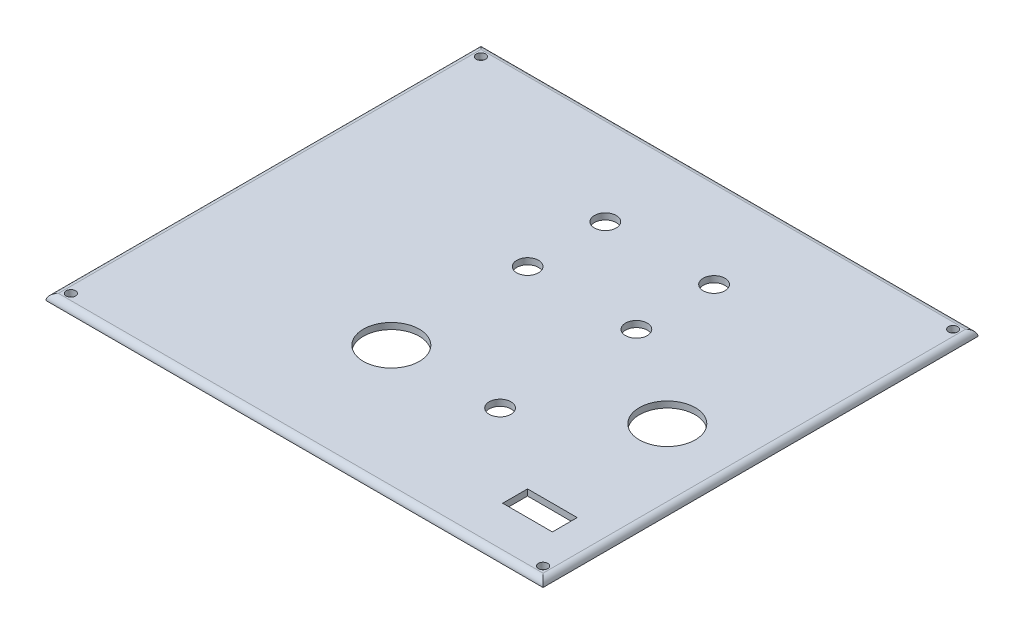
ISO-10303-21;
HEADER;
FILE_DESCRIPTION(('STEP AP214'),'2;1');
FILE_NAME('part.step','',(''),(''),'','','');
FILE_SCHEMA(('AUTOMOTIVE_DESIGN { 1 0 10303 214 1 1 1 1 }'));
ENDSEC;
DATA;
#1=APPLICATION_CONTEXT('core data for automotive mechanical design processes');
#2=APPLICATION_PROTOCOL_DEFINITION('international standard','automotive_design',2000,#1);
#3=PRODUCT_CONTEXT('',#1,'mechanical');
#4=PRODUCT('Part','Part','',(#3));
#5=PRODUCT_RELATED_PRODUCT_CATEGORY('part','',(#4));
#6=PRODUCT_DEFINITION_FORMATION('','',#4);
#7=PRODUCT_DEFINITION_CONTEXT('part definition',#1,'design');
#8=PRODUCT_DEFINITION('design','',#6,#7);
#9=PRODUCT_DEFINITION_SHAPE('','',#8);
#10=(LENGTH_UNIT() NAMED_UNIT(*) SI_UNIT(.MILLI.,.METRE.));
#11=(NAMED_UNIT(*) PLANE_ANGLE_UNIT() SI_UNIT($,.RADIAN.));
#12=(NAMED_UNIT(*) SI_UNIT($,.STERADIAN.) SOLID_ANGLE_UNIT());
#13=UNCERTAINTY_MEASURE_WITH_UNIT(LENGTH_MEASURE(1.E-05),#10,'distance_accuracy_value','');
#14=(GEOMETRIC_REPRESENTATION_CONTEXT(3) GLOBAL_UNCERTAINTY_ASSIGNED_CONTEXT((#13)) GLOBAL_UNIT_ASSIGNED_CONTEXT((#10,
#11,#12)) REPRESENTATION_CONTEXT('',''));
#15=CARTESIAN_POINT('',(0.,0.,0.));
#16=DIRECTION('',(0.,0.,1.));
#17=DIRECTION('',(1.,0.,0.));
#18=AXIS2_PLACEMENT_3D('',#15,#16,#17);
#19=CARTESIAN_POINT('',(0.,2.,0.));
#20=DIRECTION('',(0.,1.,0.));
#21=DIRECTION('',(0.,0.,1.));
#22=AXIS2_PLACEMENT_3D('',#19,#20,#21);
#23=PLANE('',#22);
#24=DIRECTION('',(0.,0.,-1.));
#25=VECTOR('',#24,1.);
#26=CARTESIAN_POINT('',(68.,2.,47.));
#27=LINE('',#26,#25);
#28=CARTESIAN_POINT('',(68.,2.,55.));
#29=VERTEX_POINT('',#28);
#30=CARTESIAN_POINT('',(68.,2.,47.));
#31=VERTEX_POINT('',#30);
#32=EDGE_CURVE('E52',#29,#31,#27,.T.);
#33=ORIENTED_EDGE('',*,*,#32,.F.);
#34=DIRECTION('',(1.,0.,0.));
#35=VECTOR('',#34,1.);
#36=CARTESIAN_POINT('',(52.,2.,55.));
#37=LINE('',#36,#35);
#38=CARTESIAN_POINT('',(52.,2.,55.));
#39=VERTEX_POINT('',#38);
#40=EDGE_CURVE('E120',#39,#29,#37,.T.);
#41=ORIENTED_EDGE('',*,*,#40,.F.);
#42=DIRECTION('',(0.,0.,1.));
#43=VECTOR('',#42,1.);
#44=CARTESIAN_POINT('',(52.,2.,47.));
#45=LINE('',#44,#43);
#46=CARTESIAN_POINT('',(52.,2.,47.));
#47=VERTEX_POINT('',#46);
#48=EDGE_CURVE('E123',#47,#39,#45,.T.);
#49=ORIENTED_EDGE('',*,*,#48,.F.);
#50=DIRECTION('',(-1.,0.,0.));
#51=VECTOR('',#50,1.);
#52=CARTESIAN_POINT('',(52.,2.,47.));
#53=LINE('',#52,#51);
#54=EDGE_CURVE('E129',#31,#47,#53,.T.);
#55=ORIENTED_EDGE('',*,*,#54,.F.);
#56=EDGE_LOOP('',(#33,#41,#49,#55));
#57=FACE_BOUND('',#56,.T.);
#58=DIRECTION('',(1.,0.,0.));
#59=VECTOR('',#58,1.);
#60=CARTESIAN_POINT('',(80.,2.,68.));
#61=LINE('',#60,#59);
#62=CARTESIAN_POINT('',(-78.,2.,68.));
#63=VERTEX_POINT('',#62);
#64=CARTESIAN_POINT('',(78.,2.,68.));
#65=VERTEX_POINT('',#64);
#66=EDGE_CURVE('E217',#63,#65,#61,.T.);
#67=ORIENTED_EDGE('',*,*,#66,.T.);
#68=DIRECTION('',(0.,0.,-1.));
#69=VECTOR('',#68,1.);
#70=CARTESIAN_POINT('',(78.,2.,-70.));
#71=LINE('',#70,#69);
#72=CARTESIAN_POINT('',(78.,2.,-68.));
#73=VERTEX_POINT('',#72);
#74=EDGE_CURVE('E11',#65,#73,#71,.T.);
#75=ORIENTED_EDGE('',*,*,#74,.T.);
#76=DIRECTION('',(-1.,0.,0.));
#77=VECTOR('',#76,1.);
#78=CARTESIAN_POINT('',(-80.,2.,-68.));
#79=LINE('',#78,#77);
#80=CARTESIAN_POINT('',(-78.,2.,-68.));
#81=VERTEX_POINT('',#80);
#82=EDGE_CURVE('E44',#73,#81,#79,.T.);
#83=ORIENTED_EDGE('',*,*,#82,.T.);
#84=DIRECTION('',(0.,0.,1.));
#85=VECTOR('',#84,1.);
#86=CARTESIAN_POINT('',(-78.,2.,70.));
#87=LINE('',#86,#85);
#88=EDGE_CURVE('E219',#81,#63,#87,.T.);
#89=ORIENTED_EDGE('',*,*,#88,.T.);
#90=EDGE_LOOP('',(#67,#75,#83,#89));
#91=FACE_BOUND('',#90,.T.);
#92=CARTESIAN_POINT('',(-9.95799999999998,2.,-40.));
#93=DIRECTION('',(0.,1.,0.));
#94=DIRECTION('',(0.,0.,1.));
#95=AXIS2_PLACEMENT_3D('',#92,#93,#94);
#96=CIRCLE('',#95,3.5);
#97=CARTESIAN_POINT('',(-9.95799999999998,2.,-36.5));
#98=VERTEX_POINT('',#97);
#99=EDGE_CURVE('E139',#98,#98,#96,.T.);
#100=ORIENTED_EDGE('',*,*,#99,.F.);
#101=EDGE_LOOP('',(#100));
#102=FACE_BOUND('',#101,.T.);
#103=CARTESIAN_POINT('',(25.042,2.,-40.));
#104=DIRECTION('',(0.,1.,0.));
#105=DIRECTION('',(0.,0.,1.));
#106=AXIS2_PLACEMENT_3D('',#103,#104,#105);
#107=CIRCLE('',#106,3.5);
#108=CARTESIAN_POINT('',(25.042,2.,-36.5));
#109=VERTEX_POINT('',#108);
#110=EDGE_CURVE('E145',#109,#109,#107,.T.);
#111=ORIENTED_EDGE('',*,*,#110,.F.);
#112=EDGE_LOOP('',(#111));
#113=FACE_BOUND('',#112,.T.);
#114=CARTESIAN_POINT('',(-9.95799999999998,2.,-15.));
#115=DIRECTION('',(0.,1.,0.));
#116=DIRECTION('',(0.,0.,1.));
#117=AXIS2_PLACEMENT_3D('',#114,#115,#116);
#118=CIRCLE('',#117,3.5);
#119=CARTESIAN_POINT('',(-9.95799999999998,2.,-11.5));
#120=VERTEX_POINT('',#119);
#121=EDGE_CURVE('E151',#120,#120,#118,.T.);
#122=ORIENTED_EDGE('',*,*,#121,.F.);
#123=EDGE_LOOP('',(#122));
#124=FACE_BOUND('',#123,.T.);
#125=CARTESIAN_POINT('',(25.042,2.,-15.));
#126=DIRECTION('',(0.,1.,0.));
#127=DIRECTION('',(0.,0.,1.));
#128=AXIS2_PLACEMENT_3D('',#125,#126,#127);
#129=CIRCLE('',#128,3.5);
#130=CARTESIAN_POINT('',(25.042,2.,-11.5));
#131=VERTEX_POINT('',#130);
#132=EDGE_CURVE('E157',#131,#131,#129,.T.);
#133=ORIENTED_EDGE('',*,*,#132,.F.);
#134=EDGE_LOOP('',(#133));
#135=FACE_BOUND('',#134,.T.);
#136=CARTESIAN_POINT('',(25.042,2.,28.878));
#137=DIRECTION('',(0.,1.,0.));
#138=DIRECTION('',(0.,0.,1.));
#139=AXIS2_PLACEMENT_3D('',#136,#137,#138);
#140=CIRCLE('',#139,3.5);
#141=CARTESIAN_POINT('',(25.042,2.,32.378));
#142=VERTEX_POINT('',#141);
#143=EDGE_CURVE('E163',#142,#142,#140,.T.);
#144=ORIENTED_EDGE('',*,*,#143,.F.);
#145=EDGE_LOOP('',(#144));
#146=FACE_BOUND('',#145,.T.);
#147=CARTESIAN_POINT('',(56.336,2.,6.34799999999999));
#148=DIRECTION('',(0.,1.,0.));
#149=DIRECTION('',(0.,0.,1.));
#150=AXIS2_PLACEMENT_3D('',#147,#148,#149);
#151=CIRCLE('',#150,8.99999999999999);
#152=CARTESIAN_POINT('',(56.336,2.,15.348));
#153=VERTEX_POINT('',#152);
#154=EDGE_CURVE('E169',#153,#153,#151,.T.);
#155=ORIENTED_EDGE('',*,*,#154,.F.);
#156=EDGE_LOOP('',(#155));
#157=FACE_BOUND('',#156,.T.);
#158=CARTESIAN_POINT('',(-9.95799999999998,2.,28.878));
#159=DIRECTION('',(0.,1.,0.));
#160=DIRECTION('',(0.,0.,1.));
#161=AXIS2_PLACEMENT_3D('',#158,#159,#160);
#162=CIRCLE('',#161,9.);
#163=CARTESIAN_POINT('',(-9.95799999999998,2.,37.878));
#164=VERTEX_POINT('',#163);
#165=EDGE_CURVE('E175',#164,#164,#162,.T.);
#166=ORIENTED_EDGE('',*,*,#165,.F.);
#167=EDGE_LOOP('',(#166));
#168=FACE_BOUND('',#167,.T.);
#169=CARTESIAN_POINT('',(-76.,2.,-66.));
#170=DIRECTION('',(0.,1.,0.));
#171=DIRECTION('',(0.,0.,1.));
#172=AXIS2_PLACEMENT_3D('',#169,#170,#171);
#173=CIRCLE('',#172,1.49999999999999);
#174=CARTESIAN_POINT('',(-76.,2.,-64.5));
#175=VERTEX_POINT('',#174);
#176=EDGE_CURVE('E181',#175,#175,#173,.T.);
#177=ORIENTED_EDGE('',*,*,#176,.F.);
#178=EDGE_LOOP('',(#177));
#179=FACE_BOUND('',#178,.T.);
#180=CARTESIAN_POINT('',(76.,2.,-66.));
#181=DIRECTION('',(0.,1.,0.));
#182=DIRECTION('',(0.,0.,1.));
#183=AXIS2_PLACEMENT_3D('',#180,#181,#182);
#184=CIRCLE('',#183,1.49999999999999);
#185=CARTESIAN_POINT('',(76.,2.,-64.5));
#186=VERTEX_POINT('',#185);
#187=EDGE_CURVE('E187',#186,#186,#184,.T.);
#188=ORIENTED_EDGE('',*,*,#187,.F.);
#189=EDGE_LOOP('',(#188));
#190=FACE_BOUND('',#189,.T.);
#191=CARTESIAN_POINT('',(76.,2.,66.));
#192=DIRECTION('',(0.,1.,0.));
#193=DIRECTION('',(0.,0.,1.));
#194=AXIS2_PLACEMENT_3D('',#191,#192,#193);
#195=CIRCLE('',#194,1.49999999999999);
#196=CARTESIAN_POINT('',(76.,2.,67.5));
#197=VERTEX_POINT('',#196);
#198=EDGE_CURVE('E193',#197,#197,#195,.T.);
#199=ORIENTED_EDGE('',*,*,#198,.F.);
#200=EDGE_LOOP('',(#199));
#201=FACE_BOUND('',#200,.T.);
#202=CARTESIAN_POINT('',(-76.,2.,66.));
#203=DIRECTION('',(0.,1.,0.));
#204=DIRECTION('',(0.,0.,1.));
#205=AXIS2_PLACEMENT_3D('',#202,#203,#204);
#206=CIRCLE('',#205,1.49999999999999);
#207=CARTESIAN_POINT('',(-76.,2.,67.5));
#208=VERTEX_POINT('',#207);
#209=EDGE_CURVE('E199',#208,#208,#206,.T.);
#210=ORIENTED_EDGE('',*,*,#209,.F.);
#211=EDGE_LOOP('',(#210));
#212=FACE_BOUND('',#211,.T.);
#213=ADVANCED_FACE('F35',(#57,#91,#102,#113,#124,#135,#146,#157,#168,#179,#190,#201,#212),#23,.T.);
#214=CARTESIAN_POINT('',(0.,0.,0.));
#215=DIRECTION('',(0.,1.,0.));
#216=DIRECTION('',(0.,0.,1.));
#217=AXIS2_PLACEMENT_3D('',#214,#215,#216);
#218=PLANE('',#217);
#219=DIRECTION('',(1.,0.,0.));
#220=VECTOR('',#219,1.);
#221=CARTESIAN_POINT('',(52.,0.,55.));
#222=LINE('',#221,#220);
#223=CARTESIAN_POINT('',(52.,0.,55.));
#224=VERTEX_POINT('',#223);
#225=CARTESIAN_POINT('',(68.,0.,55.));
#226=VERTEX_POINT('',#225);
#227=EDGE_CURVE('E110',#224,#226,#222,.T.);
#228=ORIENTED_EDGE('',*,*,#227,.T.);
#229=DIRECTION('',(0.,0.,-1.));
#230=VECTOR('',#229,1.);
#231=CARTESIAN_POINT('',(68.,0.,47.));
#232=LINE('',#231,#230);
#233=CARTESIAN_POINT('',(68.,0.,47.));
#234=VERTEX_POINT('',#233);
#235=EDGE_CURVE('E104',#226,#234,#232,.T.);
#236=ORIENTED_EDGE('',*,*,#235,.T.);
#237=DIRECTION('',(-1.,0.,0.));
#238=VECTOR('',#237,1.);
#239=CARTESIAN_POINT('',(52.,0.,47.));
#240=LINE('',#239,#238);
#241=CARTESIAN_POINT('',(52.,0.,47.));
#242=VERTEX_POINT('',#241);
#243=EDGE_CURVE('E113',#234,#242,#240,.T.);
#244=ORIENTED_EDGE('',*,*,#243,.T.);
#245=DIRECTION('',(0.,0.,1.));
#246=VECTOR('',#245,1.);
#247=CARTESIAN_POINT('',(52.,0.,47.));
#248=LINE('',#247,#246);
#249=EDGE_CURVE('E60',#242,#224,#248,.T.);
#250=ORIENTED_EDGE('',*,*,#249,.T.);
#251=EDGE_LOOP('',(#228,#236,#244,#250));
#252=FACE_BOUND('',#251,.T.);
#253=CARTESIAN_POINT('',(-9.95799999999998,0.,-40.));
#254=DIRECTION('',(0.,1.,0.));
#255=DIRECTION('',(0.,0.,1.));
#256=AXIS2_PLACEMENT_3D('',#253,#254,#255);
#257=CIRCLE('',#256,3.5);
#258=CARTESIAN_POINT('',(-9.95799999999998,0.,-36.5));
#259=VERTEX_POINT('',#258);
#260=EDGE_CURVE('E142',#259,#259,#257,.T.);
#261=ORIENTED_EDGE('',*,*,#260,.T.);
#262=EDGE_LOOP('',(#261));
#263=FACE_BOUND('',#262,.T.);
#264=CARTESIAN_POINT('',(25.042,0.,-40.));
#265=DIRECTION('',(0.,1.,0.));
#266=DIRECTION('',(0.,0.,1.));
#267=AXIS2_PLACEMENT_3D('',#264,#265,#266);
#268=CIRCLE('',#267,3.5);
#269=CARTESIAN_POINT('',(25.042,0.,-36.5));
#270=VERTEX_POINT('',#269);
#271=EDGE_CURVE('E148',#270,#270,#268,.T.);
#272=ORIENTED_EDGE('',*,*,#271,.T.);
#273=EDGE_LOOP('',(#272));
#274=FACE_BOUND('',#273,.T.);
#275=CARTESIAN_POINT('',(-9.95799999999998,0.,-15.));
#276=DIRECTION('',(0.,1.,0.));
#277=DIRECTION('',(0.,0.,1.));
#278=AXIS2_PLACEMENT_3D('',#275,#276,#277);
#279=CIRCLE('',#278,3.5);
#280=CARTESIAN_POINT('',(-9.95799999999998,0.,-11.5));
#281=VERTEX_POINT('',#280);
#282=EDGE_CURVE('E154',#281,#281,#279,.T.);
#283=ORIENTED_EDGE('',*,*,#282,.T.);
#284=EDGE_LOOP('',(#283));
#285=FACE_BOUND('',#284,.T.);
#286=CARTESIAN_POINT('',(25.042,0.,-15.));
#287=DIRECTION('',(0.,1.,0.));
#288=DIRECTION('',(0.,0.,1.));
#289=AXIS2_PLACEMENT_3D('',#286,#287,#288);
#290=CIRCLE('',#289,3.5);
#291=CARTESIAN_POINT('',(25.042,0.,-11.5));
#292=VERTEX_POINT('',#291);
#293=EDGE_CURVE('E160',#292,#292,#290,.T.);
#294=ORIENTED_EDGE('',*,*,#293,.T.);
#295=EDGE_LOOP('',(#294));
#296=FACE_BOUND('',#295,.T.);
#297=CARTESIAN_POINT('',(25.042,0.,28.878));
#298=DIRECTION('',(0.,1.,0.));
#299=DIRECTION('',(0.,0.,1.));
#300=AXIS2_PLACEMENT_3D('',#297,#298,#299);
#301=CIRCLE('',#300,3.5);
#302=CARTESIAN_POINT('',(25.042,0.,32.378));
#303=VERTEX_POINT('',#302);
#304=EDGE_CURVE('E166',#303,#303,#301,.T.);
#305=ORIENTED_EDGE('',*,*,#304,.T.);
#306=EDGE_LOOP('',(#305));
#307=FACE_BOUND('',#306,.T.);
#308=CARTESIAN_POINT('',(56.336,0.,6.34799999999999));
#309=DIRECTION('',(0.,1.,0.));
#310=DIRECTION('',(0.,0.,1.));
#311=AXIS2_PLACEMENT_3D('',#308,#309,#310);
#312=CIRCLE('',#311,8.99999999999999);
#313=CARTESIAN_POINT('',(56.336,0.,15.348));
#314=VERTEX_POINT('',#313);
#315=EDGE_CURVE('E172',#314,#314,#312,.T.);
#316=ORIENTED_EDGE('',*,*,#315,.T.);
#317=EDGE_LOOP('',(#316));
#318=FACE_BOUND('',#317,.T.);
#319=CARTESIAN_POINT('',(-9.95799999999998,0.,28.878));
#320=DIRECTION('',(0.,1.,0.));
#321=DIRECTION('',(0.,0.,1.));
#322=AXIS2_PLACEMENT_3D('',#319,#320,#321);
#323=CIRCLE('',#322,9.);
#324=CARTESIAN_POINT('',(-9.95799999999998,0.,37.878));
#325=VERTEX_POINT('',#324);
#326=EDGE_CURVE('E178',#325,#325,#323,.T.);
#327=ORIENTED_EDGE('',*,*,#326,.T.);
#328=EDGE_LOOP('',(#327));
#329=FACE_BOUND('',#328,.T.);
#330=CARTESIAN_POINT('',(-76.,0.,-66.));
#331=DIRECTION('',(0.,1.,0.));
#332=DIRECTION('',(0.,0.,1.));
#333=AXIS2_PLACEMENT_3D('',#330,#331,#332);
#334=CIRCLE('',#333,1.5);
#335=CARTESIAN_POINT('',(-76.,0.,-64.5));
#336=VERTEX_POINT('',#335);
#337=EDGE_CURVE('E184',#336,#336,#334,.T.);
#338=ORIENTED_EDGE('',*,*,#337,.T.);
#339=EDGE_LOOP('',(#338));
#340=FACE_BOUND('',#339,.T.);
#341=CARTESIAN_POINT('',(76.,0.,-66.));
#342=DIRECTION('',(0.,1.,0.));
#343=DIRECTION('',(0.,0.,1.));
#344=AXIS2_PLACEMENT_3D('',#341,#342,#343);
#345=CIRCLE('',#344,1.5);
#346=CARTESIAN_POINT('',(76.,0.,-64.5));
#347=VERTEX_POINT('',#346);
#348=EDGE_CURVE('E190',#347,#347,#345,.T.);
#349=ORIENTED_EDGE('',*,*,#348,.T.);
#350=EDGE_LOOP('',(#349));
#351=FACE_BOUND('',#350,.T.);
#352=CARTESIAN_POINT('',(76.,0.,66.));
#353=DIRECTION('',(0.,1.,0.));
#354=DIRECTION('',(0.,0.,1.));
#355=AXIS2_PLACEMENT_3D('',#352,#353,#354);
#356=CIRCLE('',#355,1.5);
#357=CARTESIAN_POINT('',(76.,0.,67.5));
#358=VERTEX_POINT('',#357);
#359=EDGE_CURVE('E196',#358,#358,#356,.T.);
#360=ORIENTED_EDGE('',*,*,#359,.T.);
#361=EDGE_LOOP('',(#360));
#362=FACE_BOUND('',#361,.T.);
#363=CARTESIAN_POINT('',(-76.,0.,66.));
#364=DIRECTION('',(0.,1.,0.));
#365=DIRECTION('',(0.,0.,1.));
#366=AXIS2_PLACEMENT_3D('',#363,#364,#365);
#367=CIRCLE('',#366,1.5);
#368=CARTESIAN_POINT('',(-76.,0.,67.5));
#369=VERTEX_POINT('',#368);
#370=EDGE_CURVE('E202',#369,#369,#367,.T.);
#371=ORIENTED_EDGE('',*,*,#370,.T.);
#372=EDGE_LOOP('',(#371));
#373=FACE_BOUND('',#372,.T.);
#374=DIRECTION('',(0.,0.,-1.));
#375=VECTOR('',#374,1.);
#376=CARTESIAN_POINT('',(80.,0.,-70.));
#377=LINE('',#376,#375);
#378=CARTESIAN_POINT('',(80.,0.,70.));
#379=VERTEX_POINT('',#378);
#380=CARTESIAN_POINT('',(80.,0.,-70.));
#381=VERTEX_POINT('',#380);
#382=EDGE_CURVE('E205',#379,#381,#377,.T.);
#383=ORIENTED_EDGE('',*,*,#382,.F.);
#384=DIRECTION('',(1.,0.,0.));
#385=VECTOR('',#384,1.);
#386=CARTESIAN_POINT('',(-80.,0.,70.));
#387=LINE('',#386,#385);
#388=CARTESIAN_POINT('',(-80.,0.,70.));
#389=VERTEX_POINT('',#388);
#390=EDGE_CURVE('E214',#389,#379,#387,.T.);
#391=ORIENTED_EDGE('',*,*,#390,.F.);
#392=DIRECTION('',(0.,0.,1.));
#393=VECTOR('',#392,1.);
#394=CARTESIAN_POINT('',(-80.,0.,-70.));
#395=LINE('',#394,#393);
#396=CARTESIAN_POINT('',(-80.,0.,-70.));
#397=VERTEX_POINT('',#396);
#398=EDGE_CURVE('E211',#397,#389,#395,.T.);
#399=ORIENTED_EDGE('',*,*,#398,.F.);
#400=DIRECTION('',(-1.,0.,0.));
#401=VECTOR('',#400,1.);
#402=CARTESIAN_POINT('',(-80.,0.,-70.));
#403=LINE('',#402,#401);
#404=EDGE_CURVE('E208',#381,#397,#403,.T.);
#405=ORIENTED_EDGE('',*,*,#404,.F.);
#406=EDGE_LOOP('',(#383,#391,#399,#405));
#407=FACE_BOUND('',#406,.T.);
#408=ADVANCED_FACE('F117',(#252,#263,#274,#285,#296,#307,#318,#329,#340,#351,#362,#373,#407),
#218,.F.);
#409=CARTESIAN_POINT('',(-76.,2.,66.));
#410=DIRECTION('',(0.,1.,0.));
#411=DIRECTION('',(0.,0.,1.));
#412=AXIS2_PLACEMENT_3D('',#409,#410,#411);
#413=CYLINDRICAL_SURFACE('',#412,1.49999999999999);
#414=ORIENTED_EDGE('',*,*,#370,.F.);
#415=EDGE_LOOP('',(#414));
#416=FACE_BOUND('',#415,.T.);
#417=ORIENTED_EDGE('',*,*,#209,.T.);
#418=EDGE_LOOP('',(#417));
#419=FACE_BOUND('',#418,.T.);
#420=ADVANCED_FACE('F271',(#416,#419),#413,.F.);
#421=CARTESIAN_POINT('',(76.,2.,66.));
#422=DIRECTION('',(0.,1.,0.));
#423=DIRECTION('',(0.,0.,1.));
#424=AXIS2_PLACEMENT_3D('',#421,#422,#423);
#425=CYLINDRICAL_SURFACE('',#424,1.49999999999999);
#426=ORIENTED_EDGE('',*,*,#359,.F.);
#427=EDGE_LOOP('',(#426));
#428=FACE_BOUND('',#427,.T.);
#429=ORIENTED_EDGE('',*,*,#198,.T.);
#430=EDGE_LOOP('',(#429));
#431=FACE_BOUND('',#430,.T.);
#432=ADVANCED_FACE('F273',(#428,#431),#425,.F.);
#433=CARTESIAN_POINT('',(76.,2.,-66.));
#434=DIRECTION('',(0.,1.,0.));
#435=DIRECTION('',(0.,0.,1.));
#436=AXIS2_PLACEMENT_3D('',#433,#434,#435);
#437=CYLINDRICAL_SURFACE('',#436,1.49999999999999);
#438=ORIENTED_EDGE('',*,*,#348,.F.);
#439=EDGE_LOOP('',(#438));
#440=FACE_BOUND('',#439,.T.);
#441=ORIENTED_EDGE('',*,*,#187,.T.);
#442=EDGE_LOOP('',(#441));
#443=FACE_BOUND('',#442,.T.);
#444=ADVANCED_FACE('F280',(#440,#443),#437,.F.);
#445=CARTESIAN_POINT('',(-76.,2.,-66.));
#446=DIRECTION('',(0.,1.,0.));
#447=DIRECTION('',(0.,0.,1.));
#448=AXIS2_PLACEMENT_3D('',#445,#446,#447);
#449=CYLINDRICAL_SURFACE('',#448,1.49999999999999);
#450=ORIENTED_EDGE('',*,*,#337,.F.);
#451=EDGE_LOOP('',(#450));
#452=FACE_BOUND('',#451,.T.);
#453=ORIENTED_EDGE('',*,*,#176,.T.);
#454=EDGE_LOOP('',(#453));
#455=FACE_BOUND('',#454,.T.);
#456=ADVANCED_FACE('F331',(#452,#455),#449,.F.);
#457=CARTESIAN_POINT('',(-9.95799999999998,2.,28.878));
#458=DIRECTION('',(0.,1.,0.));
#459=DIRECTION('',(0.,0.,1.));
#460=AXIS2_PLACEMENT_3D('',#457,#458,#459);
#461=CYLINDRICAL_SURFACE('',#460,9.);
#462=ORIENTED_EDGE('',*,*,#326,.F.);
#463=EDGE_LOOP('',(#462));
#464=FACE_BOUND('',#463,.T.);
#465=ORIENTED_EDGE('',*,*,#165,.T.);
#466=EDGE_LOOP('',(#465));
#467=FACE_BOUND('',#466,.T.);
#468=ADVANCED_FACE('F327',(#464,#467),#461,.F.);
#469=CARTESIAN_POINT('',(56.336,2.,6.34799999999999));
#470=DIRECTION('',(0.,1.,0.));
#471=DIRECTION('',(0.,0.,1.));
#472=AXIS2_PLACEMENT_3D('',#469,#470,#471);
#473=CYLINDRICAL_SURFACE('',#472,8.99999999999999);
#474=ORIENTED_EDGE('',*,*,#315,.F.);
#475=EDGE_LOOP('',(#474));
#476=FACE_BOUND('',#475,.T.);
#477=ORIENTED_EDGE('',*,*,#154,.T.);
#478=EDGE_LOOP('',(#477));
#479=FACE_BOUND('',#478,.T.);
#480=ADVANCED_FACE('F323',(#476,#479),#473,.F.);
#481=CARTESIAN_POINT('',(25.042,2.,28.878));
#482=DIRECTION('',(0.,1.,0.));
#483=DIRECTION('',(0.,0.,1.));
#484=AXIS2_PLACEMENT_3D('',#481,#482,#483);
#485=CYLINDRICAL_SURFACE('',#484,3.5);
#486=ORIENTED_EDGE('',*,*,#304,.F.);
#487=EDGE_LOOP('',(#486));
#488=FACE_BOUND('',#487,.T.);
#489=ORIENTED_EDGE('',*,*,#143,.T.);
#490=EDGE_LOOP('',(#489));
#491=FACE_BOUND('',#490,.T.);
#492=ADVANCED_FACE('F319',(#488,#491),#485,.F.);
#493=CARTESIAN_POINT('',(25.042,2.,-15.));
#494=DIRECTION('',(0.,1.,0.));
#495=DIRECTION('',(0.,0.,1.));
#496=AXIS2_PLACEMENT_3D('',#493,#494,#495);
#497=CYLINDRICAL_SURFACE('',#496,3.5);
#498=ORIENTED_EDGE('',*,*,#293,.F.);
#499=EDGE_LOOP('',(#498));
#500=FACE_BOUND('',#499,.T.);
#501=ORIENTED_EDGE('',*,*,#132,.T.);
#502=EDGE_LOOP('',(#501));
#503=FACE_BOUND('',#502,.T.);
#504=ADVANCED_FACE('F315',(#500,#503),#497,.F.);
#505=CARTESIAN_POINT('',(-9.95799999999998,2.,-15.));
#506=DIRECTION('',(0.,1.,0.));
#507=DIRECTION('',(0.,0.,1.));
#508=AXIS2_PLACEMENT_3D('',#505,#506,#507);
#509=CYLINDRICAL_SURFACE('',#508,3.5);
#510=ORIENTED_EDGE('',*,*,#282,.F.);
#511=EDGE_LOOP('',(#510));
#512=FACE_BOUND('',#511,.T.);
#513=ORIENTED_EDGE('',*,*,#121,.T.);
#514=EDGE_LOOP('',(#513));
#515=FACE_BOUND('',#514,.T.);
#516=ADVANCED_FACE('F305',(#512,#515),#509,.F.);
#517=CARTESIAN_POINT('',(25.042,2.,-40.));
#518=DIRECTION('',(0.,1.,0.));
#519=DIRECTION('',(0.,0.,1.));
#520=AXIS2_PLACEMENT_3D('',#517,#518,#519);
#521=CYLINDRICAL_SURFACE('',#520,3.5);
#522=ORIENTED_EDGE('',*,*,#271,.F.);
#523=EDGE_LOOP('',(#522));
#524=FACE_BOUND('',#523,.T.);
#525=ORIENTED_EDGE('',*,*,#110,.T.);
#526=EDGE_LOOP('',(#525));
#527=FACE_BOUND('',#526,.T.);
#528=ADVANCED_FACE('F299',(#524,#527),#521,.F.);
#529=CARTESIAN_POINT('',(-9.95799999999998,2.,-40.));
#530=DIRECTION('',(0.,1.,0.));
#531=DIRECTION('',(0.,0.,1.));
#532=AXIS2_PLACEMENT_3D('',#529,#530,#531);
#533=CYLINDRICAL_SURFACE('',#532,3.5);
#534=ORIENTED_EDGE('',*,*,#260,.F.);
#535=EDGE_LOOP('',(#534));
#536=FACE_BOUND('',#535,.T.);
#537=ORIENTED_EDGE('',*,*,#99,.T.);
#538=EDGE_LOOP('',(#537));
#539=FACE_BOUND('',#538,.T.);
#540=ADVANCED_FACE('F295',(#536,#539),#533,.F.);
#541=CARTESIAN_POINT('',(-78.,0.,0.));
#542=DIRECTION('',(0.,0.,-1.));
#543=DIRECTION('',(-1.,0.,0.));
#544=AXIS2_PLACEMENT_3D('',#541,#542,#543);
#545=CYLINDRICAL_SURFACE('',#544,2.);
#546=CARTESIAN_POINT('',(-78.,0.,-68.));
#547=DIRECTION('',(0.707106781186547,0.,-0.707106781186547));
#548=DIRECTION('',(-0.707106781186547,0.,-0.707106781186547));
#549=AXIS2_PLACEMENT_3D('',#546,#547,#548);
#550=ELLIPSE('',#549,2.82842712474619,2.);
#551=EDGE_CURVE('E224',#397,#81,#550,.T.);
#552=ORIENTED_EDGE('',*,*,#551,.F.);
#553=ORIENTED_EDGE('',*,*,#398,.T.);
#554=CARTESIAN_POINT('',(-78.,0.,68.));
#555=DIRECTION('',(-0.707106781186547,0.,-0.707106781186547));
#556=DIRECTION('',(-0.707106781186547,0.,0.707106781186547));
#557=AXIS2_PLACEMENT_3D('',#554,#555,#556);
#558=ELLIPSE('',#557,2.82842712474619,2.);
#559=EDGE_CURVE('E39',#63,#389,#558,.F.);
#560=ORIENTED_EDGE('',*,*,#559,.F.);
#561=ORIENTED_EDGE('',*,*,#88,.F.);
#562=EDGE_LOOP('',(#552,#553,#560,#561));
#563=FACE_BOUND('',#562,.T.);
#564=ADVANCED_FACE('F37',(#563),#545,.T.);
#565=CARTESIAN_POINT('',(0.,0.,68.));
#566=DIRECTION('',(-1.,0.,0.));
#567=DIRECTION('',(0.,0.,1.));
#568=AXIS2_PLACEMENT_3D('',#565,#566,#567);
#569=CYLINDRICAL_SURFACE('',#568,2.);
#570=ORIENTED_EDGE('',*,*,#559,.T.);
#571=ORIENTED_EDGE('',*,*,#390,.T.);
#572=CARTESIAN_POINT('',(78.,0.,68.));
#573=DIRECTION('',(-0.707106781186547,0.,0.707106781186548));
#574=DIRECTION('',(-0.707106781186547,0.,-0.707106781186547));
#575=AXIS2_PLACEMENT_3D('',#572,#573,#574);
#576=ELLIPSE('',#575,2.82842712474619,2.);
#577=EDGE_CURVE('E223',#65,#379,#576,.F.);
#578=ORIENTED_EDGE('',*,*,#577,.F.);
#579=ORIENTED_EDGE('',*,*,#66,.F.);
#580=EDGE_LOOP('',(#570,#571,#578,#579));
#581=FACE_BOUND('',#580,.T.);
#582=ADVANCED_FACE('F233',(#581),#569,.T.);
#583=CARTESIAN_POINT('',(0.,0.,-68.));
#584=DIRECTION('',(1.,0.,0.));
#585=DIRECTION('',(0.,0.,-1.));
#586=AXIS2_PLACEMENT_3D('',#583,#584,#585);
#587=CYLINDRICAL_SURFACE('',#586,2.);
#588=ORIENTED_EDGE('',*,*,#551,.T.);
#589=ORIENTED_EDGE('',*,*,#82,.F.);
#590=CARTESIAN_POINT('',(78.,0.,-68.));
#591=DIRECTION('',(0.707106781186547,0.,0.707106781186547));
#592=DIRECTION('',(0.707106781186547,0.,-0.707106781186548));
#593=AXIS2_PLACEMENT_3D('',#590,#591,#592);
#594=ELLIPSE('',#593,2.82842712474619,2.);
#595=EDGE_CURVE('E135',#381,#73,#594,.T.);
#596=ORIENTED_EDGE('',*,*,#595,.F.);
#597=ORIENTED_EDGE('',*,*,#404,.T.);
#598=EDGE_LOOP('',(#588,#589,#596,#597));
#599=FACE_BOUND('',#598,.T.);
#600=ADVANCED_FACE('F243',(#599),#587,.T.);
#601=CARTESIAN_POINT('',(78.,0.,0.));
#602=DIRECTION('',(0.,0.,1.));
#603=DIRECTION('',(1.,0.,0.));
#604=AXIS2_PLACEMENT_3D('',#601,#602,#603);
#605=CYLINDRICAL_SURFACE('',#604,2.);
#606=ORIENTED_EDGE('',*,*,#577,.T.);
#607=ORIENTED_EDGE('',*,*,#382,.T.);
#608=ORIENTED_EDGE('',*,*,#595,.T.);
#609=ORIENTED_EDGE('',*,*,#74,.F.);
#610=EDGE_LOOP('',(#606,#607,#608,#609));
#611=FACE_BOUND('',#610,.T.);
#612=ADVANCED_FACE('F241',(#611),#605,.T.);
#613=CARTESIAN_POINT('',(68.,0.,47.));
#614=DIRECTION('',(1.,0.,0.));
#615=DIRECTION('',(0.,0.,-1.));
#616=AXIS2_PLACEMENT_3D('',#613,#614,#615);
#617=PLANE('',#616);
#618=ORIENTED_EDGE('',*,*,#32,.T.);
#619=DIRECTION('',(0.,1.,0.));
#620=VECTOR('',#619,1.);
#621=CARTESIAN_POINT('',(68.,0.,47.));
#622=LINE('',#621,#620);
#623=EDGE_CURVE('E100',#234,#31,#622,.T.);
#624=ORIENTED_EDGE('',*,*,#623,.F.);
#625=ORIENTED_EDGE('',*,*,#235,.F.);
#626=DIRECTION('',(0.,1.,0.));
#627=VECTOR('',#626,1.);
#628=CARTESIAN_POINT('',(68.,0.,55.));
#629=LINE('',#628,#627);
#630=EDGE_CURVE('E133',#226,#29,#629,.T.);
#631=ORIENTED_EDGE('',*,*,#630,.T.);
#632=EDGE_LOOP('',(#618,#624,#625,#631));
#633=FACE_BOUND('',#632,.T.);
#634=ADVANCED_FACE('F102',(#633),#617,.F.);
#635=CARTESIAN_POINT('',(52.,0.,55.));
#636=DIRECTION('',(0.,0.,1.));
#637=DIRECTION('',(1.,0.,0.));
#638=AXIS2_PLACEMENT_3D('',#635,#636,#637);
#639=PLANE('',#638);
#640=ORIENTED_EDGE('',*,*,#40,.T.);
#641=ORIENTED_EDGE('',*,*,#630,.F.);
#642=ORIENTED_EDGE('',*,*,#227,.F.);
#643=DIRECTION('',(0.,1.,0.));
#644=VECTOR('',#643,1.);
#645=CARTESIAN_POINT('',(52.,0.,55.));
#646=LINE('',#645,#644);
#647=EDGE_CURVE('E136',#224,#39,#646,.T.);
#648=ORIENTED_EDGE('',*,*,#647,.T.);
#649=EDGE_LOOP('',(#640,#641,#642,#648));
#650=FACE_BOUND('',#649,.T.);
#651=ADVANCED_FACE('F416',(#650),#639,.F.);
#652=CARTESIAN_POINT('',(52.,0.,47.));
#653=DIRECTION('',(-1.,0.,0.));
#654=DIRECTION('',(0.,0.,1.));
#655=AXIS2_PLACEMENT_3D('',#652,#653,#654);
#656=PLANE('',#655);
#657=ORIENTED_EDGE('',*,*,#48,.T.);
#658=ORIENTED_EDGE('',*,*,#647,.F.);
#659=ORIENTED_EDGE('',*,*,#249,.F.);
#660=DIRECTION('',(0.,1.,0.));
#661=VECTOR('',#660,1.);
#662=CARTESIAN_POINT('',(52.,0.,47.));
#663=LINE('',#662,#661);
#664=EDGE_CURVE('E109',#242,#47,#663,.T.);
#665=ORIENTED_EDGE('',*,*,#664,.T.);
#666=EDGE_LOOP('',(#657,#658,#659,#665));
#667=FACE_BOUND('',#666,.T.);
#668=ADVANCED_FACE('F424',(#667),#656,.F.);
#669=CARTESIAN_POINT('',(52.,0.,47.));
#670=DIRECTION('',(0.,0.,-1.));
#671=DIRECTION('',(-1.,0.,0.));
#672=AXIS2_PLACEMENT_3D('',#669,#670,#671);
#673=PLANE('',#672);
#674=ORIENTED_EDGE('',*,*,#54,.T.);
#675=ORIENTED_EDGE('',*,*,#664,.F.);
#676=ORIENTED_EDGE('',*,*,#243,.F.);
#677=ORIENTED_EDGE('',*,*,#623,.T.);
#678=EDGE_LOOP('',(#674,#675,#676,#677));
#679=FACE_BOUND('',#678,.T.);
#680=ADVANCED_FACE('F114',(#679),#673,.F.);
#681=CLOSED_SHELL('',(#213,#408,#420,#432,#444,#456,#468,#480,#492,#504,#516,#528,#540,#564,
#582,#600,#612,#634,#651,#668,#680));
#682=MANIFOLD_SOLID_BREP('B2',#681);
#683=ADVANCED_BREP_SHAPE_REPRESENTATION('',(#18,#682),#14);
#684=SHAPE_DEFINITION_REPRESENTATION(#9,#683);
ENDSEC;
END-ISO-10303-21;
